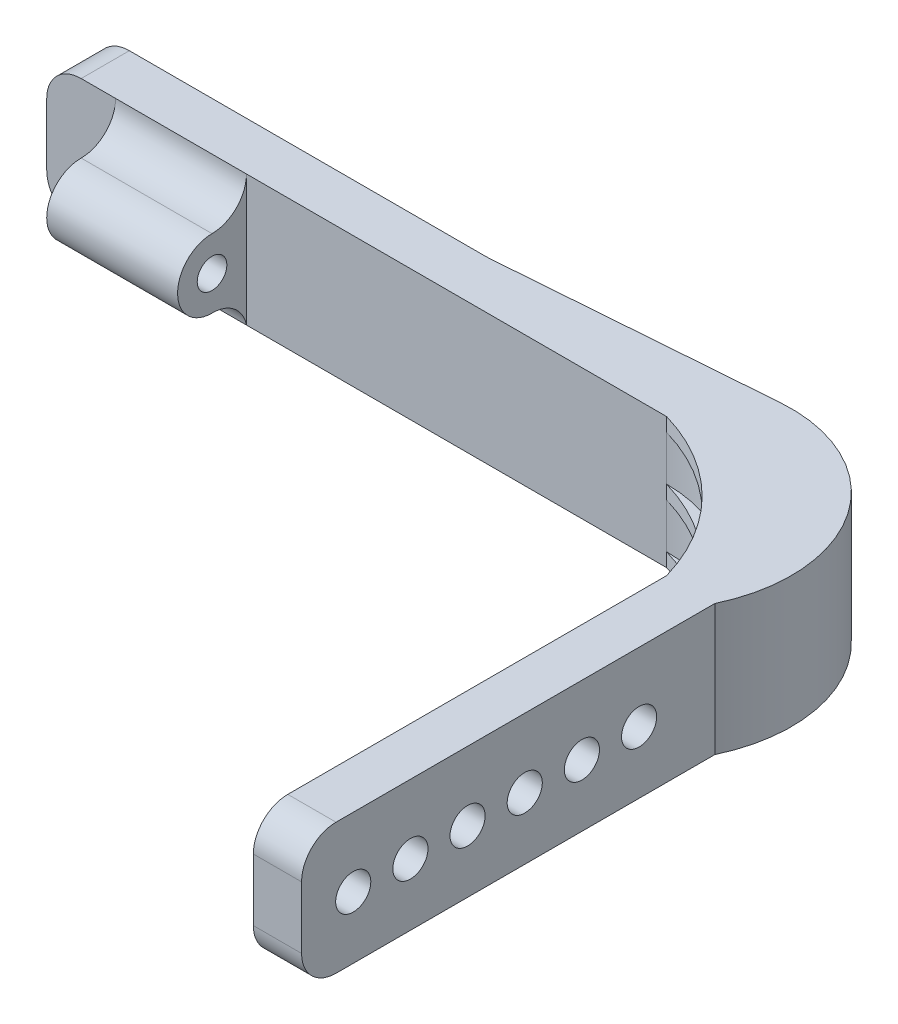
ISO-10303-21;
HEADER;
FILE_DESCRIPTION(('STEP AP214'),'2;1');
FILE_NAME('part.step','',(''),(''),'','','');
FILE_SCHEMA(('AUTOMOTIVE_DESIGN { 1 0 10303 214 1 1 1 1 }'));
ENDSEC;
DATA;
#1=APPLICATION_CONTEXT('core data for automotive mechanical design processes');
#2=APPLICATION_PROTOCOL_DEFINITION('international standard','automotive_design',2000,#1);
#3=PRODUCT_CONTEXT('',#1,'mechanical');
#4=PRODUCT('Part','Part','',(#3));
#5=PRODUCT_RELATED_PRODUCT_CATEGORY('part','',(#4));
#6=PRODUCT_DEFINITION_FORMATION('','',#4);
#7=PRODUCT_DEFINITION_CONTEXT('part definition',#1,'design');
#8=PRODUCT_DEFINITION('design','',#6,#7);
#9=PRODUCT_DEFINITION_SHAPE('','',#8);
#10=(LENGTH_UNIT() NAMED_UNIT(*) SI_UNIT(.MILLI.,.METRE.));
#11=(NAMED_UNIT(*) PLANE_ANGLE_UNIT() SI_UNIT($,.RADIAN.));
#12=(NAMED_UNIT(*) SI_UNIT($,.STERADIAN.) SOLID_ANGLE_UNIT());
#13=UNCERTAINTY_MEASURE_WITH_UNIT(LENGTH_MEASURE(1.E-05),#10,'distance_accuracy_value','');
#14=(GEOMETRIC_REPRESENTATION_CONTEXT(3) GLOBAL_UNCERTAINTY_ASSIGNED_CONTEXT((#13)) GLOBAL_UNIT_ASSIGNED_CONTEXT((#10,
#11,#12)) REPRESENTATION_CONTEXT('',''));
#15=CARTESIAN_POINT('',(0.,0.,0.));
#16=DIRECTION('',(0.,0.,1.));
#17=DIRECTION('',(1.,0.,0.));
#18=AXIS2_PLACEMENT_3D('',#15,#16,#17);
#19=CARTESIAN_POINT('',(0.,19.,7.));
#20=DIRECTION('',(0.,0.,-1.));
#21=DIRECTION('',(-1.,0.,0.));
#22=AXIS2_PLACEMENT_3D('',#19,#20,#21);
#23=PLANE('',#22);
#24=DIRECTION('',(1.,0.,0.));
#25=VECTOR('',#24,1.);
#26=CARTESIAN_POINT('',(0.,0.,7.));
#27=LINE('',#26,#25);
#28=CARTESIAN_POINT('',(5.,0.,7.));
#29=VERTEX_POINT('',#28);
#30=CARTESIAN_POINT('',(10.,0.,7.));
#31=VERTEX_POINT('',#30);
#32=EDGE_CURVE('E343',#29,#31,#27,.T.);
#33=ORIENTED_EDGE('',*,*,#32,.T.);
#34=DIRECTION('',(0.,-1.,0.));
#35=VECTOR('',#34,1.);
#36=CARTESIAN_POINT('',(10.,14.,7.));
#37=LINE('',#36,#35);
#38=CARTESIAN_POINT('',(10.,19.,7.));
#39=VERTEX_POINT('',#38);
#40=EDGE_CURVE('E225',#39,#31,#37,.T.);
#41=ORIENTED_EDGE('',*,*,#40,.F.);
#42=DIRECTION('',(1.,0.,0.));
#43=VECTOR('',#42,1.);
#44=CARTESIAN_POINT('',(0.,19.,7.));
#45=LINE('',#44,#43);
#46=CARTESIAN_POINT('',(5.,19.,7.));
#47=VERTEX_POINT('',#46);
#48=EDGE_CURVE('E326',#47,#39,#45,.T.);
#49=ORIENTED_EDGE('',*,*,#48,.F.);
#50=CARTESIAN_POINT('',(5.,14.,7.));
#51=DIRECTION('',(0.,0.,-1.));
#52=DIRECTION('',(-1.,0.,0.));
#53=AXIS2_PLACEMENT_3D('',#50,#51,#52);
#54=CIRCLE('',#53,5.);
#55=CARTESIAN_POINT('',(0.,14.,7.));
#56=VERTEX_POINT('',#55);
#57=EDGE_CURVE('E462',#47,#56,#54,.F.);
#58=ORIENTED_EDGE('',*,*,#57,.T.);
#59=DIRECTION('',(0.,-1.,0.));
#60=VECTOR('',#59,1.);
#61=CARTESIAN_POINT('',(0.,19.,7.));
#62=LINE('',#61,#60);
#63=CARTESIAN_POINT('',(0.,5.,7.));
#64=VERTEX_POINT('',#63);
#65=EDGE_CURVE('E384',#56,#64,#62,.T.);
#66=ORIENTED_EDGE('',*,*,#65,.T.);
#67=CARTESIAN_POINT('',(5.,5.,7.));
#68=DIRECTION('',(0.,0.,-1.));
#69=DIRECTION('',(-1.,0.,0.));
#70=AXIS2_PLACEMENT_3D('',#67,#68,#69);
#71=CIRCLE('',#70,5.);
#72=EDGE_CURVE('E465',#64,#29,#71,.F.);
#73=ORIENTED_EDGE('',*,*,#72,.T.);
#74=EDGE_LOOP('',(#33,#41,#49,#58,#66,#73));
#75=FACE_BOUND('',#74,.T.);
#76=ADVANCED_FACE('F43',(#75),#23,.F.);
#77=CARTESIAN_POINT('',(90.,19.,27.));
#78=DIRECTION('',(0.,-1.,0.));
#79=DIRECTION('',(0.,0.,-1.));
#80=AXIS2_PLACEMENT_3D('',#77,#78,#79);
#81=CYLINDRICAL_SURFACE('',#80,20.);
#82=DIRECTION('',(0.,-1.,0.));
#83=VECTOR('',#82,1.);
#84=CARTESIAN_POINT('',(110.,19.,27.));
#85=LINE('',#84,#83);
#86=CARTESIAN_POINT('',(110.,17.,27.));
#87=VERTEX_POINT('',#86);
#88=CARTESIAN_POINT('',(110.,10.5,27.));
#89=VERTEX_POINT('',#88);
#90=EDGE_CURVE('E379',#87,#89,#85,.T.);
#91=ORIENTED_EDGE('',*,*,#90,.F.);
#92=CARTESIAN_POINT('',(90.,17.,27.));
#93=DIRECTION('',(0.,1.,0.));
#94=DIRECTION('',(0.,0.,-1.));
#95=AXIS2_PLACEMENT_3D('',#92,#93,#94);
#96=CIRCLE('',#95,20.);
#97=CARTESIAN_POINT('',(90.,17.,7.));
#98=VERTEX_POINT('',#97);
#99=EDGE_CURVE('E235',#87,#98,#96,.T.);
#100=ORIENTED_EDGE('',*,*,#99,.T.);
#101=DIRECTION('',(0.,-1.,0.));
#102=VECTOR('',#101,1.);
#103=CARTESIAN_POINT('',(90.,19.,7.));
#104=LINE('',#103,#102);
#105=CARTESIAN_POINT('',(90.,10.5,7.));
#106=VERTEX_POINT('',#105);
#107=EDGE_CURVE('E385',#98,#106,#104,.T.);
#108=ORIENTED_EDGE('',*,*,#107,.T.);
#109=CARTESIAN_POINT('',(90.,10.5,27.));
#110=DIRECTION('',(0.,1.,0.));
#111=DIRECTION('',(0.,0.,-1.));
#112=AXIS2_PLACEMENT_3D('',#109,#110,#111);
#113=CIRCLE('',#112,20.);
#114=EDGE_CURVE('E248',#89,#106,#113,.T.);
#115=ORIENTED_EDGE('',*,*,#114,.F.);
#116=EDGE_LOOP('',(#91,#100,#108,#115));
#117=FACE_BOUND('',#116,.T.);
#118=ADVANCED_FACE('F550',(#117),#81,.F.);
#119=CARTESIAN_POINT('',(110.,8.5,27.));
#120=VERTEX_POINT('',#119);
#121=CARTESIAN_POINT('',(110.,2.,27.));
#122=VERTEX_POINT('',#121);
#123=EDGE_CURVE('E373',#120,#122,#85,.T.);
#124=ORIENTED_EDGE('',*,*,#123,.F.);
#125=CARTESIAN_POINT('',(90.,8.5,27.));
#126=DIRECTION('',(0.,1.,0.));
#127=DIRECTION('',(0.,0.,-1.));
#128=AXIS2_PLACEMENT_3D('',#125,#126,#127);
#129=CIRCLE('',#128,20.);
#130=CARTESIAN_POINT('',(90.,8.5,7.));
#131=VERTEX_POINT('',#130);
#132=EDGE_CURVE('E241',#120,#131,#129,.T.);
#133=ORIENTED_EDGE('',*,*,#132,.T.);
#134=CARTESIAN_POINT('',(90.,2.,7.));
#135=VERTEX_POINT('',#134);
#136=EDGE_CURVE('E378',#131,#135,#104,.T.);
#137=ORIENTED_EDGE('',*,*,#136,.T.);
#138=CARTESIAN_POINT('',(90.,2.,27.));
#139=DIRECTION('',(0.,1.,0.));
#140=DIRECTION('',(0.,0.,-1.));
#141=AXIS2_PLACEMENT_3D('',#138,#139,#140);
#142=CIRCLE('',#141,20.);
#143=EDGE_CURVE('E272',#122,#135,#142,.T.);
#144=ORIENTED_EDGE('',*,*,#143,.F.);
#145=EDGE_LOOP('',(#124,#133,#137,#144));
#146=FACE_BOUND('',#145,.T.);
#147=ADVANCED_FACE('F528',(#146),#81,.F.);
#148=CARTESIAN_POINT('',(0.,19.,0.));
#149=DIRECTION('',(0.,0.,1.));
#150=DIRECTION('',(1.,0.,0.));
#151=AXIS2_PLACEMENT_3D('',#148,#149,#150);
#152=PLANE('',#151);
#153=DIRECTION('',(-1.,0.,0.));
#154=VECTOR('',#153,1.);
#155=CARTESIAN_POINT('',(0.,19.,0.));
#156=LINE('',#155,#154);
#157=CARTESIAN_POINT('',(56.3075252884527,19.,0.));
#158=VERTEX_POINT('',#157);
#159=CARTESIAN_POINT('',(5.,19.,0.));
#160=VERTEX_POINT('',#159);
#161=EDGE_CURVE('E339',#158,#160,#156,.T.);
#162=ORIENTED_EDGE('',*,*,#161,.F.);
#163=DIRECTION('',(0.,-1.,0.));
#164=VECTOR('',#163,1.);
#165=CARTESIAN_POINT('',(56.3075252884527,0.,0.));
#166=LINE('',#165,#164);
#167=CARTESIAN_POINT('',(56.3075252884527,0.,0.));
#168=VERTEX_POINT('',#167);
#169=EDGE_CURVE('E475',#158,#168,#166,.T.);
#170=ORIENTED_EDGE('',*,*,#169,.T.);
#171=DIRECTION('',(-1.,0.,0.));
#172=VECTOR('',#171,1.);
#173=CARTESIAN_POINT('',(0.,0.,0.));
#174=LINE('',#173,#172);
#175=CARTESIAN_POINT('',(5.,0.,0.));
#176=VERTEX_POINT('',#175);
#177=EDGE_CURVE('E355',#168,#176,#174,.T.);
#178=ORIENTED_EDGE('',*,*,#177,.T.);
#179=CARTESIAN_POINT('',(5.,5.,0.));
#180=DIRECTION('',(0.,0.,1.));
#181=DIRECTION('',(1.,0.,0.));
#182=AXIS2_PLACEMENT_3D('',#179,#180,#181);
#183=CIRCLE('',#182,5.);
#184=CARTESIAN_POINT('',(0.,5.,0.));
#185=VERTEX_POINT('',#184);
#186=EDGE_CURVE('E472',#176,#185,#183,.F.);
#187=ORIENTED_EDGE('',*,*,#186,.T.);
#188=DIRECTION('',(0.,-1.,0.));
#189=VECTOR('',#188,1.);
#190=CARTESIAN_POINT('',(0.,19.,0.));
#191=LINE('',#190,#189);
#192=CARTESIAN_POINT('',(0.,14.,0.));
#193=VERTEX_POINT('',#192);
#194=EDGE_CURVE('E342',#193,#185,#191,.T.);
#195=ORIENTED_EDGE('',*,*,#194,.F.);
#196=CARTESIAN_POINT('',(5.,14.,0.));
#197=DIRECTION('',(0.,0.,1.));
#198=DIRECTION('',(1.,0.,0.));
#199=AXIS2_PLACEMENT_3D('',#196,#197,#198);
#200=CIRCLE('',#199,5.);
#201=EDGE_CURVE('E468',#193,#160,#200,.F.);
#202=ORIENTED_EDGE('',*,*,#201,.T.);
#203=EDGE_LOOP('',(#162,#170,#178,#187,#195,#202));
#204=FACE_BOUND('',#203,.T.);
#205=ADVANCED_FACE('F586',(#204),#152,.F.);
#206=CARTESIAN_POINT('',(117.,9.,38.));
#207=DIRECTION('',(-1.,0.,0.));
#208=DIRECTION('',(0.,0.,1.));
#209=AXIS2_PLACEMENT_3D('',#206,#207,#208);
#210=CYLINDRICAL_SURFACE('',#209,2.54999999999999);
#211=CARTESIAN_POINT('',(117.,9.,38.));
#212=DIRECTION('',(1.,0.,0.));
#213=DIRECTION('',(0.,0.,-1.));
#214=AXIS2_PLACEMENT_3D('',#211,#212,#213);
#215=CIRCLE('',#214,2.54999999999999);
#216=CARTESIAN_POINT('',(117.,9.,35.45));
#217=VERTEX_POINT('',#216);
#218=EDGE_CURVE('E413',#217,#217,#215,.T.);
#219=ORIENTED_EDGE('',*,*,#218,.T.);
#220=EDGE_LOOP('',(#219));
#221=FACE_BOUND('',#220,.T.);
#222=CARTESIAN_POINT('',(110.,9.,38.));
#223=DIRECTION('',(1.,0.,0.));
#224=DIRECTION('',(0.,0.,-1.));
#225=AXIS2_PLACEMENT_3D('',#222,#223,#224);
#226=CIRCLE('',#225,2.54999999999999);
#227=CARTESIAN_POINT('',(110.,9.,35.45));
#228=VERTEX_POINT('',#227);
#229=EDGE_CURVE('E417',#228,#228,#226,.F.);
#230=ORIENTED_EDGE('',*,*,#229,.T.);
#231=EDGE_LOOP('',(#230));
#232=FACE_BOUND('',#231,.T.);
#233=ADVANCED_FACE('F582',(#221,#232),#210,.F.);
#234=CARTESIAN_POINT('',(117.,9.,46.3));
#235=DIRECTION('',(-1.,0.,0.));
#236=DIRECTION('',(0.,0.,1.));
#237=AXIS2_PLACEMENT_3D('',#234,#235,#236);
#238=CYLINDRICAL_SURFACE('',#237,2.54999999999999);
#239=CARTESIAN_POINT('',(117.,9.,46.3));
#240=DIRECTION('',(1.,0.,0.));
#241=DIRECTION('',(0.,0.,-1.));
#242=AXIS2_PLACEMENT_3D('',#239,#240,#241);
#243=CIRCLE('',#242,2.54999999999999);
#244=CARTESIAN_POINT('',(117.,9.,43.75));
#245=VERTEX_POINT('',#244);
#246=EDGE_CURVE('E405',#245,#245,#243,.T.);
#247=ORIENTED_EDGE('',*,*,#246,.T.);
#248=EDGE_LOOP('',(#247));
#249=FACE_BOUND('',#248,.T.);
#250=CARTESIAN_POINT('',(110.,9.,46.3));
#251=DIRECTION('',(1.,0.,0.));
#252=DIRECTION('',(0.,0.,-1.));
#253=AXIS2_PLACEMENT_3D('',#250,#251,#252);
#254=CIRCLE('',#253,2.54999999999999);
#255=CARTESIAN_POINT('',(110.,9.,43.75));
#256=VERTEX_POINT('',#255);
#257=EDGE_CURVE('E409',#256,#256,#254,.F.);
#258=ORIENTED_EDGE('',*,*,#257,.T.);
#259=EDGE_LOOP('',(#258));
#260=FACE_BOUND('',#259,.T.);
#261=ADVANCED_FACE('F578',(#249,#260),#238,.F.);
#262=CARTESIAN_POINT('',(117.,9.,54.6));
#263=DIRECTION('',(-1.,0.,0.));
#264=DIRECTION('',(0.,0.,1.));
#265=AXIS2_PLACEMENT_3D('',#262,#263,#264);
#266=CYLINDRICAL_SURFACE('',#265,2.54999999999999);
#267=CARTESIAN_POINT('',(117.,9.,54.6));
#268=DIRECTION('',(1.,0.,0.));
#269=DIRECTION('',(0.,0.,-1.));
#270=AXIS2_PLACEMENT_3D('',#267,#268,#269);
#271=CIRCLE('',#270,2.54999999999999);
#272=CARTESIAN_POINT('',(117.,9.,52.05));
#273=VERTEX_POINT('',#272);
#274=EDGE_CURVE('E397',#273,#273,#271,.T.);
#275=ORIENTED_EDGE('',*,*,#274,.T.);
#276=EDGE_LOOP('',(#275));
#277=FACE_BOUND('',#276,.T.);
#278=CARTESIAN_POINT('',(110.,9.,54.6));
#279=DIRECTION('',(1.,0.,0.));
#280=DIRECTION('',(0.,0.,-1.));
#281=AXIS2_PLACEMENT_3D('',#278,#279,#280);
#282=CIRCLE('',#281,2.54999999999999);
#283=CARTESIAN_POINT('',(110.,9.,52.05));
#284=VERTEX_POINT('',#283);
#285=EDGE_CURVE('E401',#284,#284,#282,.F.);
#286=ORIENTED_EDGE('',*,*,#285,.T.);
#287=EDGE_LOOP('',(#286));
#288=FACE_BOUND('',#287,.T.);
#289=ADVANCED_FACE('F572',(#277,#288),#266,.F.);
#290=CARTESIAN_POINT('',(117.,9.,62.9));
#291=DIRECTION('',(-1.,0.,0.));
#292=DIRECTION('',(0.,0.,1.));
#293=AXIS2_PLACEMENT_3D('',#290,#291,#292);
#294=CYLINDRICAL_SURFACE('',#293,2.54999999999999);
#295=CARTESIAN_POINT('',(117.,9.,62.9));
#296=DIRECTION('',(1.,0.,0.));
#297=DIRECTION('',(0.,0.,-1.));
#298=AXIS2_PLACEMENT_3D('',#295,#296,#297);
#299=CIRCLE('',#298,2.54999999999999);
#300=CARTESIAN_POINT('',(117.,9.,60.35));
#301=VERTEX_POINT('',#300);
#302=EDGE_CURVE('E389',#301,#301,#299,.T.);
#303=ORIENTED_EDGE('',*,*,#302,.T.);
#304=EDGE_LOOP('',(#303));
#305=FACE_BOUND('',#304,.T.);
#306=CARTESIAN_POINT('',(110.,9.,62.9));
#307=DIRECTION('',(1.,0.,0.));
#308=DIRECTION('',(0.,0.,-1.));
#309=AXIS2_PLACEMENT_3D('',#306,#307,#308);
#310=CIRCLE('',#309,2.54999999999999);
#311=CARTESIAN_POINT('',(110.,9.,60.35));
#312=VERTEX_POINT('',#311);
#313=EDGE_CURVE('E393',#312,#312,#310,.F.);
#314=ORIENTED_EDGE('',*,*,#313,.T.);
#315=EDGE_LOOP('',(#314));
#316=FACE_BOUND('',#315,.T.);
#317=ADVANCED_FACE('F567',(#305,#316),#294,.F.);
#318=CARTESIAN_POINT('',(0.,19.,7.));
#319=DIRECTION('',(1.,0.,0.));
#320=DIRECTION('',(0.,0.,-1.));
#321=AXIS2_PLACEMENT_3D('',#318,#319,#320);
#322=PLANE('',#321);
#323=ORIENTED_EDGE('',*,*,#194,.T.);
#324=DIRECTION('',(0.,0.,1.));
#325=VECTOR('',#324,1.);
#326=CARTESIAN_POINT('',(0.,5.,7.));
#327=LINE('',#326,#325);
#328=EDGE_CURVE('E458',#185,#64,#327,.T.);
#329=ORIENTED_EDGE('',*,*,#328,.T.);
#330=ORIENTED_EDGE('',*,*,#65,.F.);
#331=DIRECTION('',(0.,0.,1.));
#332=VECTOR('',#331,1.);
#333=CARTESIAN_POINT('',(0.,14.,7.));
#334=LINE('',#333,#332);
#335=EDGE_CURVE('E455',#56,#193,#334,.F.);
#336=ORIENTED_EDGE('',*,*,#335,.T.);
#337=EDGE_LOOP('',(#323,#329,#330,#336));
#338=FACE_BOUND('',#337,.T.);
#339=ADVANCED_FACE('F559',(#338),#322,.F.);
#340=DIRECTION('',(0.,-1.,0.));
#341=VECTOR('',#340,1.);
#342=CARTESIAN_POINT('',(29.,14.,7.));
#343=LINE('',#342,#341);
#344=CARTESIAN_POINT('',(29.,19.,7.));
#345=VERTEX_POINT('',#344);
#346=CARTESIAN_POINT('',(29.,0.,7.));
#347=VERTEX_POINT('',#346);
#348=EDGE_CURVE('E207',#345,#347,#343,.T.);
#349=ORIENTED_EDGE('',*,*,#348,.T.);
#350=CARTESIAN_POINT('',(90.,0.,7.));
#351=VERTEX_POINT('',#350);
#352=EDGE_CURVE('E325',#347,#351,#27,.T.);
#353=ORIENTED_EDGE('',*,*,#352,.T.);
#354=DIRECTION('',(0.,-1.,0.));
#355=VECTOR('',#354,1.);
#356=CARTESIAN_POINT('',(90.,2.,7.));
#357=LINE('',#356,#355);
#358=EDGE_CURVE('E287',#135,#351,#357,.T.);
#359=ORIENTED_EDGE('',*,*,#358,.F.);
#360=ORIENTED_EDGE('',*,*,#136,.F.);
#361=DIRECTION('',(0.,-1.,0.));
#362=VECTOR('',#361,1.);
#363=CARTESIAN_POINT('',(90.,10.5,7.));
#364=LINE('',#363,#362);
#365=EDGE_CURVE('E267',#106,#131,#364,.T.);
#366=ORIENTED_EDGE('',*,*,#365,.F.);
#367=ORIENTED_EDGE('',*,*,#107,.F.);
#368=CARTESIAN_POINT('',(90.,19.,7.));
#369=VERTEX_POINT('',#368);
#370=EDGE_CURVE('E380',#369,#98,#104,.T.);
#371=ORIENTED_EDGE('',*,*,#370,.F.);
#372=EDGE_CURVE('E332',#345,#369,#45,.T.);
#373=ORIENTED_EDGE('',*,*,#372,.F.);
#374=EDGE_LOOP('',(#349,#353,#359,#360,#366,#367,#371,#373));
#375=FACE_BOUND('',#374,.T.);
#376=ADVANCED_FACE('F516',(#375),#23,.F.);
#377=CARTESIAN_POINT('',(110.,19.,27.));
#378=DIRECTION('',(1.,0.,0.));
#379=DIRECTION('',(0.,0.,-1.));
#380=AXIS2_PLACEMENT_3D('',#377,#378,#379);
#381=PLANE('',#380);
#382=CARTESIAN_POINT('',(110.,9.,71.2));
#383=DIRECTION('',(1.,0.,0.));
#384=DIRECTION('',(0.,0.,-1.));
#385=AXIS2_PLACEMENT_3D('',#382,#383,#384);
#386=CIRCLE('',#385,2.54999999999999);
#387=CARTESIAN_POINT('',(110.,9.,68.65));
#388=VERTEX_POINT('',#387);
#389=EDGE_CURVE('E313',#388,#388,#386,.F.);
#390=ORIENTED_EDGE('',*,*,#389,.F.);
#391=EDGE_LOOP('',(#390));
#392=FACE_BOUND('',#391,.T.);
#393=CARTESIAN_POINT('',(110.,9.,79.5));
#394=DIRECTION('',(1.,0.,0.));
#395=DIRECTION('',(0.,0.,-1.));
#396=AXIS2_PLACEMENT_3D('',#393,#394,#395);
#397=CIRCLE('',#396,2.54999999999999);
#398=CARTESIAN_POINT('',(110.,9.,76.95));
#399=VERTEX_POINT('',#398);
#400=EDGE_CURVE('E321',#399,#399,#397,.F.);
#401=ORIENTED_EDGE('',*,*,#400,.F.);
#402=EDGE_LOOP('',(#401));
#403=FACE_BOUND('',#402,.T.);
#404=DIRECTION('',(0.,0.,1.));
#405=VECTOR('',#404,1.);
#406=CARTESIAN_POINT('',(110.,0.,27.));
#407=LINE('',#406,#405);
#408=CARTESIAN_POINT('',(110.,0.,27.));
#409=VERTEX_POINT('',#408);
#410=CARTESIAN_POINT('',(110.,0.,82.));
#411=VERTEX_POINT('',#410);
#412=EDGE_CURVE('E347',#409,#411,#407,.T.);
#413=ORIENTED_EDGE('',*,*,#412,.T.);
#414=CARTESIAN_POINT('',(110.,5.,82.));
#415=DIRECTION('',(1.,0.,0.));
#416=DIRECTION('',(0.,0.,-1.));
#417=AXIS2_PLACEMENT_3D('',#414,#415,#416);
#418=CIRCLE('',#417,5.);
#419=CARTESIAN_POINT('',(110.,5.,87.));
#420=VERTEX_POINT('',#419);
#421=EDGE_CURVE('E444',#411,#420,#418,.F.);
#422=ORIENTED_EDGE('',*,*,#421,.T.);
#423=DIRECTION('',(0.,-1.,0.));
#424=VECTOR('',#423,1.);
#425=CARTESIAN_POINT('',(110.,19.,87.));
#426=LINE('',#425,#424);
#427=CARTESIAN_POINT('',(110.,14.,87.));
#428=VERTEX_POINT('',#427);
#429=EDGE_CURVE('E369',#428,#420,#426,.T.);
#430=ORIENTED_EDGE('',*,*,#429,.F.);
#431=CARTESIAN_POINT('',(110.,14.,82.));
#432=DIRECTION('',(1.,0.,0.));
#433=DIRECTION('',(0.,0.,-1.));
#434=AXIS2_PLACEMENT_3D('',#431,#432,#433);
#435=CIRCLE('',#434,5.);
#436=CARTESIAN_POINT('',(110.,19.,82.));
#437=VERTEX_POINT('',#436);
#438=EDGE_CURVE('E441',#428,#437,#435,.F.);
#439=ORIENTED_EDGE('',*,*,#438,.T.);
#440=DIRECTION('',(0.,0.,1.));
#441=VECTOR('',#440,1.);
#442=CARTESIAN_POINT('',(110.,19.,27.));
#443=LINE('',#442,#441);
#444=CARTESIAN_POINT('',(110.,19.,27.));
#445=VERTEX_POINT('',#444);
#446=EDGE_CURVE('E330',#445,#437,#443,.T.);
#447=ORIENTED_EDGE('',*,*,#446,.F.);
#448=EDGE_CURVE('E374',#445,#87,#85,.T.);
#449=ORIENTED_EDGE('',*,*,#448,.T.);
#450=ORIENTED_EDGE('',*,*,#90,.T.);
#451=DIRECTION('',(0.,-1.,0.));
#452=VECTOR('',#451,1.);
#453=CARTESIAN_POINT('',(110.,10.5,27.));
#454=LINE('',#453,#452);
#455=EDGE_CURVE('E257',#89,#120,#454,.T.);
#456=ORIENTED_EDGE('',*,*,#455,.T.);
#457=ORIENTED_EDGE('',*,*,#123,.T.);
#458=DIRECTION('',(0.,-1.,0.));
#459=VECTOR('',#458,1.);
#460=CARTESIAN_POINT('',(110.,2.,27.));
#461=LINE('',#460,#459);
#462=EDGE_CURVE('E280',#122,#409,#461,.T.);
#463=ORIENTED_EDGE('',*,*,#462,.T.);
#464=EDGE_LOOP('',(#413,#422,#430,#439,#447,#449,#450,#456,#457,#463));
#465=FACE_BOUND('',#464,.T.);
#466=ORIENTED_EDGE('',*,*,#313,.F.);
#467=EDGE_LOOP('',(#466));
#468=FACE_BOUND('',#467,.T.);
#469=ORIENTED_EDGE('',*,*,#285,.F.);
#470=EDGE_LOOP('',(#469));
#471=FACE_BOUND('',#470,.T.);
#472=ORIENTED_EDGE('',*,*,#257,.F.);
#473=EDGE_LOOP('',(#472));
#474=FACE_BOUND('',#473,.T.);
#475=ORIENTED_EDGE('',*,*,#229,.F.);
#476=EDGE_LOOP('',(#475));
#477=FACE_BOUND('',#476,.T.);
#478=ADVANCED_FACE('F558',(#392,#403,#465,#468,#471,#474,#477),#381,.F.);
#479=CARTESIAN_POINT('',(110.,19.,87.));
#480=DIRECTION('',(0.,0.,-1.));
#481=DIRECTION('',(-1.,0.,0.));
#482=AXIS2_PLACEMENT_3D('',#479,#480,#481);
#483=PLANE('',#482);
#484=ORIENTED_EDGE('',*,*,#429,.T.);
#485=DIRECTION('',(1.,0.,0.));
#486=VECTOR('',#485,1.);
#487=CARTESIAN_POINT('',(117.,5.,87.));
#488=LINE('',#487,#486);
#489=CARTESIAN_POINT('',(117.,5.,87.));
#490=VERTEX_POINT('',#489);
#491=EDGE_CURVE('E424',#420,#490,#488,.T.);
#492=ORIENTED_EDGE('',*,*,#491,.T.);
#493=DIRECTION('',(0.,-1.,0.));
#494=VECTOR('',#493,1.);
#495=CARTESIAN_POINT('',(117.,19.,87.));
#496=LINE('',#495,#494);
#497=CARTESIAN_POINT('',(117.,14.,87.));
#498=VERTEX_POINT('',#497);
#499=EDGE_CURVE('E365',#498,#490,#496,.T.);
#500=ORIENTED_EDGE('',*,*,#499,.F.);
#501=DIRECTION('',(1.,0.,0.));
#502=VECTOR('',#501,1.);
#503=CARTESIAN_POINT('',(110.,14.,87.));
#504=LINE('',#503,#502);
#505=EDGE_CURVE('E421',#498,#428,#504,.F.);
#506=ORIENTED_EDGE('',*,*,#505,.T.);
#507=EDGE_LOOP('',(#484,#492,#500,#506));
#508=FACE_BOUND('',#507,.T.);
#509=ADVANCED_FACE('F564',(#508),#483,.F.);
#510=CARTESIAN_POINT('',(117.,19.,27.));
#511=DIRECTION('',(-1.,0.,0.));
#512=DIRECTION('',(0.,0.,1.));
#513=AXIS2_PLACEMENT_3D('',#510,#511,#512);
#514=PLANE('',#513);
#515=CARTESIAN_POINT('',(117.,9.,71.2));
#516=DIRECTION('',(1.,0.,0.));
#517=DIRECTION('',(0.,0.,-1.));
#518=AXIS2_PLACEMENT_3D('',#515,#516,#517);
#519=CIRCLE('',#518,2.54999999999999);
#520=CARTESIAN_POINT('',(117.,9.,68.65));
#521=VERTEX_POINT('',#520);
#522=EDGE_CURVE('E300',#521,#521,#519,.T.);
#523=ORIENTED_EDGE('',*,*,#522,.F.);
#524=EDGE_LOOP('',(#523));
#525=FACE_BOUND('',#524,.T.);
#526=CARTESIAN_POINT('',(117.,9.,79.5));
#527=DIRECTION('',(1.,0.,0.));
#528=DIRECTION('',(0.,0.,-1.));
#529=AXIS2_PLACEMENT_3D('',#526,#527,#528);
#530=CIRCLE('',#529,2.54999999999999);
#531=CARTESIAN_POINT('',(117.,9.,76.95));
#532=VERTEX_POINT('',#531);
#533=EDGE_CURVE('E317',#532,#532,#530,.T.);
#534=ORIENTED_EDGE('',*,*,#533,.F.);
#535=EDGE_LOOP('',(#534));
#536=FACE_BOUND('',#535,.T.);
#537=ORIENTED_EDGE('',*,*,#499,.T.);
#538=CARTESIAN_POINT('',(117.,5.,82.));
#539=DIRECTION('',(-1.,0.,0.));
#540=DIRECTION('',(0.,0.,1.));
#541=AXIS2_PLACEMENT_3D('',#538,#539,#540);
#542=CIRCLE('',#541,5.);
#543=CARTESIAN_POINT('',(117.,0.,82.));
#544=VERTEX_POINT('',#543);
#545=EDGE_CURVE('E431',#490,#544,#542,.F.);
#546=ORIENTED_EDGE('',*,*,#545,.T.);
#547=DIRECTION('',(0.,0.,-1.));
#548=VECTOR('',#547,1.);
#549=CARTESIAN_POINT('',(117.,0.,27.));
#550=LINE('',#549,#548);
#551=CARTESIAN_POINT('',(117.,0.,27.));
#552=VERTEX_POINT('',#551);
#553=EDGE_CURVE('E352',#544,#552,#550,.T.);
#554=ORIENTED_EDGE('',*,*,#553,.T.);
#555=DIRECTION('',(0.,-1.,0.));
#556=VECTOR('',#555,1.);
#557=CARTESIAN_POINT('',(117.,19.,27.));
#558=LINE('',#557,#556);
#559=CARTESIAN_POINT('',(117.,19.,27.));
#560=VERTEX_POINT('',#559);
#561=EDGE_CURVE('E361',#560,#552,#558,.T.);
#562=ORIENTED_EDGE('',*,*,#561,.F.);
#563=DIRECTION('',(0.,0.,-1.));
#564=VECTOR('',#563,1.);
#565=CARTESIAN_POINT('',(117.,19.,27.));
#566=LINE('',#565,#564);
#567=CARTESIAN_POINT('',(117.,19.,82.));
#568=VERTEX_POINT('',#567);
#569=EDGE_CURVE('E336',#568,#560,#566,.T.);
#570=ORIENTED_EDGE('',*,*,#569,.F.);
#571=CARTESIAN_POINT('',(117.,14.,82.));
#572=DIRECTION('',(-1.,0.,0.));
#573=DIRECTION('',(0.,0.,1.));
#574=AXIS2_PLACEMENT_3D('',#571,#572,#573);
#575=CIRCLE('',#574,5.);
#576=EDGE_CURVE('E428',#568,#498,#575,.F.);
#577=ORIENTED_EDGE('',*,*,#576,.T.);
#578=EDGE_LOOP('',(#537,#546,#554,#562,#570,#577));
#579=FACE_BOUND('',#578,.T.);
#580=ORIENTED_EDGE('',*,*,#302,.F.);
#581=EDGE_LOOP('',(#580));
#582=FACE_BOUND('',#581,.T.);
#583=ORIENTED_EDGE('',*,*,#274,.F.);
#584=EDGE_LOOP('',(#583));
#585=FACE_BOUND('',#584,.T.);
#586=ORIENTED_EDGE('',*,*,#246,.F.);
#587=EDGE_LOOP('',(#586));
#588=FACE_BOUND('',#587,.T.);
#589=ORIENTED_EDGE('',*,*,#218,.F.);
#590=EDGE_LOOP('',(#589));
#591=FACE_BOUND('',#590,.T.);
#592=ADVANCED_FACE('F708',(#525,#536,#579,#582,#585,#588,#591),#514,.F.);
#593=CARTESIAN_POINT('',(90.,19.,27.));
#594=DIRECTION('',(0.,-1.,0.));
#595=DIRECTION('',(0.,0.,-1.));
#596=AXIS2_PLACEMENT_3D('',#593,#594,#595);
#597=PLANE('',#596);
#598=DIRECTION('',(0.99711264567793,0.,-0.0759366303516227));
#599=VECTOR('',#598,1.);
#600=CARTESIAN_POINT('',(57.0679894567205,19.,0.));
#601=LINE('',#600,#599);
#602=CARTESIAN_POINT('',(57.8262578954852,19.,-0.0577470864414026));
#603=VERTEX_POINT('',#602);
#604=CARTESIAN_POINT('',(96.4605451071684,19.,-3.));
#605=VERTEX_POINT('',#604);
#606=EDGE_CURVE('E292',#603,#605,#601,.T.);
#607=ORIENTED_EDGE('',*,*,#606,.F.);
#608=CARTESIAN_POINT('',(56.3075252884527,19.,-20.));
#609=DIRECTION('',(0.,-1.,0.));
#610=DIRECTION('',(0.,0.,-1.));
#611=AXIS2_PLACEMENT_3D('',#608,#609,#610);
#612=CIRCLE('',#611,20.);
#613=EDGE_CURVE('E485',#603,#158,#612,.T.);
#614=ORIENTED_EDGE('',*,*,#613,.T.);
#615=ORIENTED_EDGE('',*,*,#161,.T.);
#616=DIRECTION('',(0.,0.,1.));
#617=VECTOR('',#616,1.);
#618=CARTESIAN_POINT('',(5.,19.,27.));
#619=LINE('',#618,#617);
#620=EDGE_CURVE('E447',#160,#47,#619,.T.);
#621=ORIENTED_EDGE('',*,*,#620,.T.);
#622=ORIENTED_EDGE('',*,*,#48,.T.);
#623=EDGE_CURVE('E331',#39,#345,#45,.T.);
#624=ORIENTED_EDGE('',*,*,#623,.T.);
#625=ORIENTED_EDGE('',*,*,#372,.T.);
#626=CARTESIAN_POINT('',(81.8988053183641,19.,35.1011946816359));
#627=DIRECTION('',(0.,-1.,0.));
#628=DIRECTION('',(0.,0.,-1.));
#629=AXIS2_PLACEMENT_3D('',#626,#627,#628);
#630=CIRCLE('',#629,29.2456235666974);
#631=EDGE_CURVE('E237',#369,#445,#630,.T.);
#632=ORIENTED_EDGE('',*,*,#631,.T.);
#633=ORIENTED_EDGE('',*,*,#446,.T.);
#634=DIRECTION('',(1.,0.,0.));
#635=VECTOR('',#634,1.);
#636=CARTESIAN_POINT('',(90.,19.,82.));
#637=LINE('',#636,#635);
#638=EDGE_CURVE('E451',#437,#568,#637,.T.);
#639=ORIENTED_EDGE('',*,*,#638,.T.);
#640=ORIENTED_EDGE('',*,*,#569,.T.);
#641=CARTESIAN_POINT('',(98.0552143445524,19.,17.9393655592365));
#642=DIRECTION('',(0.,-1.,0.));
#643=DIRECTION('',(0.,0.,-1.));
#644=AXIS2_PLACEMENT_3D('',#641,#642,#643);
#645=CIRCLE('',#644,21.);
#646=EDGE_CURVE('E295',#605,#560,#645,.T.);
#647=ORIENTED_EDGE('',*,*,#646,.F.);
#648=EDGE_LOOP('',(#607,#614,#615,#621,#622,#624,#625,#632,#633,#639,#640,#647));
#649=FACE_BOUND('',#648,.T.);
#650=ADVANCED_FACE('F503',(#649),#597,.F.);
#651=CARTESIAN_POINT('',(90.,0.,27.));
#652=DIRECTION('',(0.,-1.,0.));
#653=DIRECTION('',(0.,0.,-1.));
#654=AXIS2_PLACEMENT_3D('',#651,#652,#653);
#655=PLANE('',#654);
#656=ORIENTED_EDGE('',*,*,#177,.F.);
#657=CARTESIAN_POINT('',(56.3075252884527,0.,-20.));
#658=DIRECTION('',(0.,-1.,0.));
#659=DIRECTION('',(0.,0.,-1.));
#660=AXIS2_PLACEMENT_3D('',#657,#658,#659);
#661=CIRCLE('',#660,20.);
#662=CARTESIAN_POINT('',(57.8262578954852,0.,-0.0577470864414026));
#663=VERTEX_POINT('',#662);
#664=EDGE_CURVE('E482',#168,#663,#661,.F.);
#665=ORIENTED_EDGE('',*,*,#664,.T.);
#666=DIRECTION('',(-0.99711264567793,0.,0.0759366303516227));
#667=VECTOR('',#666,1.);
#668=CARTESIAN_POINT('',(57.0679894567205,0.,0.));
#669=LINE('',#668,#667);
#670=CARTESIAN_POINT('',(96.4605451071684,0.,-3.));
#671=VERTEX_POINT('',#670);
#672=EDGE_CURVE('E304',#671,#663,#669,.T.);
#673=ORIENTED_EDGE('',*,*,#672,.F.);
#674=CARTESIAN_POINT('',(98.0552143445524,0.,17.9393655592365));
#675=DIRECTION('',(0.,1.,0.));
#676=DIRECTION('',(0.,0.,1.));
#677=AXIS2_PLACEMENT_3D('',#674,#675,#676);
#678=CIRCLE('',#677,21.);
#679=EDGE_CURVE('E291',#552,#671,#678,.T.);
#680=ORIENTED_EDGE('',*,*,#679,.F.);
#681=ORIENTED_EDGE('',*,*,#553,.F.);
#682=DIRECTION('',(1.,0.,0.));
#683=VECTOR('',#682,1.);
#684=CARTESIAN_POINT('',(110.,0.,82.));
#685=LINE('',#684,#683);
#686=EDGE_CURVE('E438',#544,#411,#685,.F.);
#687=ORIENTED_EDGE('',*,*,#686,.T.);
#688=ORIENTED_EDGE('',*,*,#412,.F.);
#689=CARTESIAN_POINT('',(81.8988053183641,0.,35.1011946816359));
#690=DIRECTION('',(0.,-1.,0.));
#691=DIRECTION('',(0.,0.,-1.));
#692=AXIS2_PLACEMENT_3D('',#689,#690,#691);
#693=CIRCLE('',#692,29.2456235666974);
#694=EDGE_CURVE('E271',#351,#409,#693,.T.);
#695=ORIENTED_EDGE('',*,*,#694,.F.);
#696=ORIENTED_EDGE('',*,*,#352,.F.);
#697=EDGE_CURVE('E348',#31,#347,#27,.T.);
#698=ORIENTED_EDGE('',*,*,#697,.F.);
#699=ORIENTED_EDGE('',*,*,#32,.F.);
#700=DIRECTION('',(0.,0.,1.));
#701=VECTOR('',#700,1.);
#702=CARTESIAN_POINT('',(5.,0.,0.));
#703=LINE('',#702,#701);
#704=EDGE_CURVE('E434',#29,#176,#703,.F.);
#705=ORIENTED_EDGE('',*,*,#704,.T.);
#706=EDGE_LOOP('',(#656,#665,#673,#680,#681,#687,#688,#695,#696,#698,#699,#705));
#707=FACE_BOUND('',#706,.T.);
#708=ADVANCED_FACE('F624',(#707),#655,.T.);
#709=CARTESIAN_POINT('',(117.,9.,79.5));
#710=DIRECTION('',(-1.,0.,0.));
#711=DIRECTION('',(0.,0.,1.));
#712=AXIS2_PLACEMENT_3D('',#709,#710,#711);
#713=CYLINDRICAL_SURFACE('',#712,2.54999999999999);
#714=ORIENTED_EDGE('',*,*,#533,.T.);
#715=EDGE_LOOP('',(#714));
#716=FACE_BOUND('',#715,.T.);
#717=ORIENTED_EDGE('',*,*,#400,.T.);
#718=EDGE_LOOP('',(#717));
#719=FACE_BOUND('',#718,.T.);
#720=ADVANCED_FACE('F721',(#716,#719),#713,.F.);
#721=CARTESIAN_POINT('',(117.,9.,71.2));
#722=DIRECTION('',(-1.,0.,0.));
#723=DIRECTION('',(0.,0.,1.));
#724=AXIS2_PLACEMENT_3D('',#721,#722,#723);
#725=CYLINDRICAL_SURFACE('',#724,2.54999999999999);
#726=ORIENTED_EDGE('',*,*,#522,.T.);
#727=EDGE_LOOP('',(#726));
#728=FACE_BOUND('',#727,.T.);
#729=ORIENTED_EDGE('',*,*,#389,.T.);
#730=EDGE_LOOP('',(#729));
#731=FACE_BOUND('',#730,.T.);
#732=ADVANCED_FACE('F592',(#728,#731),#725,.F.);
#733=CARTESIAN_POINT('',(110.,5.,82.));
#734=DIRECTION('',(-1.,0.,0.));
#735=DIRECTION('',(0.,0.,1.));
#736=AXIS2_PLACEMENT_3D('',#733,#734,#735);
#737=CYLINDRICAL_SURFACE('',#736,5.);
#738=ORIENTED_EDGE('',*,*,#421,.F.);
#739=ORIENTED_EDGE('',*,*,#686,.F.);
#740=ORIENTED_EDGE('',*,*,#545,.F.);
#741=ORIENTED_EDGE('',*,*,#491,.F.);
#742=EDGE_LOOP('',(#738,#739,#740,#741));
#743=FACE_BOUND('',#742,.T.);
#744=ADVANCED_FACE('F588',(#743),#737,.T.);
#745=CARTESIAN_POINT('',(90.,14.,82.));
#746=DIRECTION('',(1.,0.,0.));
#747=DIRECTION('',(0.,0.,-1.));
#748=AXIS2_PLACEMENT_3D('',#745,#746,#747);
#749=CYLINDRICAL_SURFACE('',#748,5.);
#750=ORIENTED_EDGE('',*,*,#438,.F.);
#751=ORIENTED_EDGE('',*,*,#505,.F.);
#752=ORIENTED_EDGE('',*,*,#576,.F.);
#753=ORIENTED_EDGE('',*,*,#638,.F.);
#754=EDGE_LOOP('',(#750,#751,#752,#753));
#755=FACE_BOUND('',#754,.T.);
#756=ADVANCED_FACE('F591',(#755),#749,.T.);
#757=CARTESIAN_POINT('',(5.,5.,7.));
#758=DIRECTION('',(0.,0.,-1.));
#759=DIRECTION('',(-1.,0.,0.));
#760=AXIS2_PLACEMENT_3D('',#757,#758,#759);
#761=CYLINDRICAL_SURFACE('',#760,5.);
#762=ORIENTED_EDGE('',*,*,#186,.F.);
#763=ORIENTED_EDGE('',*,*,#704,.F.);
#764=ORIENTED_EDGE('',*,*,#72,.F.);
#765=ORIENTED_EDGE('',*,*,#328,.F.);
#766=EDGE_LOOP('',(#762,#763,#764,#765));
#767=FACE_BOUND('',#766,.T.);
#768=ADVANCED_FACE('F596',(#767),#761,.T.);
#769=CARTESIAN_POINT('',(5.,14.,27.));
#770=DIRECTION('',(0.,0.,1.));
#771=DIRECTION('',(1.,0.,0.));
#772=AXIS2_PLACEMENT_3D('',#769,#770,#771);
#773=CYLINDRICAL_SURFACE('',#772,5.);
#774=ORIENTED_EDGE('',*,*,#201,.F.);
#775=ORIENTED_EDGE('',*,*,#335,.F.);
#776=ORIENTED_EDGE('',*,*,#57,.F.);
#777=ORIENTED_EDGE('',*,*,#620,.F.);
#778=EDGE_LOOP('',(#774,#775,#776,#777));
#779=FACE_BOUND('',#778,.T.);
#780=ADVANCED_FACE('F600',(#779),#773,.T.);
#781=CARTESIAN_POINT('',(57.0679894567205,87.8916380432043,0.));
#782=DIRECTION('',(0.0759366303516227,0.,0.99711264567793));
#783=DIRECTION('',(0.99711264567793,0.,-0.0759366303516227));
#784=AXIS2_PLACEMENT_3D('',#781,#782,#783);
#785=PLANE('',#784);
#786=ORIENTED_EDGE('',*,*,#672,.T.);
#787=DIRECTION('',(0.,-1.,0.));
#788=VECTOR('',#787,1.);
#789=CARTESIAN_POINT('',(57.8262578954852,19.,-0.0577470864414065));
#790=LINE('',#789,#788);
#791=EDGE_CURVE('E479',#663,#603,#790,.F.);
#792=ORIENTED_EDGE('',*,*,#791,.T.);
#793=ORIENTED_EDGE('',*,*,#606,.T.);
#794=DIRECTION('',(0.,-1.,0.));
#795=VECTOR('',#794,1.);
#796=CARTESIAN_POINT('',(96.4605451071684,87.8916380432043,-3.));
#797=LINE('',#796,#795);
#798=EDGE_CURVE('E296',#605,#671,#797,.T.);
#799=ORIENTED_EDGE('',*,*,#798,.T.);
#800=EDGE_LOOP('',(#786,#792,#793,#799));
#801=FACE_BOUND('',#800,.T.);
#802=ADVANCED_FACE('F604',(#801),#785,.F.);
#803=CARTESIAN_POINT('',(98.0552143445524,87.8916380432043,17.9393655592365));
#804=DIRECTION('',(0.,-1.,0.));
#805=DIRECTION('',(0.,0.,-1.));
#806=AXIS2_PLACEMENT_3D('',#803,#804,#805);
#807=CYLINDRICAL_SURFACE('',#806,21.);
#808=ORIENTED_EDGE('',*,*,#798,.F.);
#809=ORIENTED_EDGE('',*,*,#646,.T.);
#810=ORIENTED_EDGE('',*,*,#561,.T.);
#811=ORIENTED_EDGE('',*,*,#679,.T.);
#812=EDGE_LOOP('',(#808,#809,#810,#811));
#813=FACE_BOUND('',#812,.T.);
#814=ADVANCED_FACE('F547',(#813),#807,.T.);
#815=CARTESIAN_POINT('',(81.8988053183641,2.,35.1011946816359));
#816=DIRECTION('',(0.,-1.,0.));
#817=DIRECTION('',(0.,0.,-1.));
#818=AXIS2_PLACEMENT_3D('',#815,#816,#817);
#819=CYLINDRICAL_SURFACE('',#818,29.2456235666974);
#820=ORIENTED_EDGE('',*,*,#694,.T.);
#821=ORIENTED_EDGE('',*,*,#462,.F.);
#822=CARTESIAN_POINT('',(81.8988053183641,2.,35.1011946816359));
#823=DIRECTION('',(0.,-1.,0.));
#824=DIRECTION('',(0.,0.,-1.));
#825=AXIS2_PLACEMENT_3D('',#822,#823,#824);
#826=CIRCLE('',#825,29.2456235666974);
#827=EDGE_CURVE('E276',#135,#122,#826,.T.);
#828=ORIENTED_EDGE('',*,*,#827,.F.);
#829=ORIENTED_EDGE('',*,*,#358,.T.);
#830=EDGE_LOOP('',(#820,#821,#828,#829));
#831=FACE_BOUND('',#830,.T.);
#832=ADVANCED_FACE('F534',(#831),#819,.F.);
#833=CARTESIAN_POINT('',(85.9494026591821,2.,31.0505973408179));
#834=DIRECTION('',(0.,-1.,0.));
#835=DIRECTION('',(0.,0.,-1.));
#836=AXIS2_PLACEMENT_3D('',#833,#834,#835);
#837=PLANE('',#836);
#838=ORIENTED_EDGE('',*,*,#143,.T.);
#839=ORIENTED_EDGE('',*,*,#827,.T.);
#840=EDGE_LOOP('',(#838,#839));
#841=FACE_BOUND('',#840,.T.);
#842=ADVANCED_FACE('F536',(#841),#837,.F.);
#843=CARTESIAN_POINT('',(81.8988053183641,10.5,35.1011946816359));
#844=DIRECTION('',(0.,-1.,0.));
#845=DIRECTION('',(0.,0.,-1.));
#846=AXIS2_PLACEMENT_3D('',#843,#844,#845);
#847=CYLINDRICAL_SURFACE('',#846,29.2456235666974);
#848=CARTESIAN_POINT('',(81.8988053183641,8.5,35.1011946816359));
#849=DIRECTION('',(0.,-1.,0.));
#850=DIRECTION('',(0.,0.,-1.));
#851=AXIS2_PLACEMENT_3D('',#848,#849,#850);
#852=CIRCLE('',#851,29.2456235666974);
#853=EDGE_CURVE('E253',#131,#120,#852,.T.);
#854=ORIENTED_EDGE('',*,*,#853,.T.);
#855=ORIENTED_EDGE('',*,*,#455,.F.);
#856=CARTESIAN_POINT('',(81.8988053183641,10.5,35.1011946816359));
#857=DIRECTION('',(0.,-1.,0.));
#858=DIRECTION('',(0.,0.,-1.));
#859=AXIS2_PLACEMENT_3D('',#856,#857,#858);
#860=CIRCLE('',#859,29.2456235666974);
#861=EDGE_CURVE('E252',#106,#89,#860,.T.);
#862=ORIENTED_EDGE('',*,*,#861,.F.);
#863=ORIENTED_EDGE('',*,*,#365,.T.);
#864=EDGE_LOOP('',(#854,#855,#862,#863));
#865=FACE_BOUND('',#864,.T.);
#866=ADVANCED_FACE('F538',(#865),#847,.F.);
#867=CARTESIAN_POINT('',(85.9494026591821,10.5,31.0505973408179));
#868=DIRECTION('',(0.,-1.,0.));
#869=DIRECTION('',(0.,0.,-1.));
#870=AXIS2_PLACEMENT_3D('',#867,#868,#869);
#871=PLANE('',#870);
#872=ORIENTED_EDGE('',*,*,#114,.T.);
#873=ORIENTED_EDGE('',*,*,#861,.T.);
#874=EDGE_LOOP('',(#872,#873));
#875=FACE_BOUND('',#874,.T.);
#876=ADVANCED_FACE('F544',(#875),#871,.F.);
#877=CARTESIAN_POINT('',(85.9494026591821,8.5,31.0505973408179));
#878=DIRECTION('',(0.,-1.,0.));
#879=DIRECTION('',(0.,0.,-1.));
#880=AXIS2_PLACEMENT_3D('',#877,#878,#879);
#881=PLANE('',#880);
#882=ORIENTED_EDGE('',*,*,#132,.F.);
#883=ORIENTED_EDGE('',*,*,#853,.F.);
#884=EDGE_LOOP('',(#882,#883));
#885=FACE_BOUND('',#884,.T.);
#886=ADVANCED_FACE('F639',(#885),#881,.T.);
#887=CARTESIAN_POINT('',(81.8988053183641,19.,35.1011946816359));
#888=DIRECTION('',(0.,-1.,0.));
#889=DIRECTION('',(0.,0.,-1.));
#890=AXIS2_PLACEMENT_3D('',#887,#888,#889);
#891=CYLINDRICAL_SURFACE('',#890,29.2456235666974);
#892=CARTESIAN_POINT('',(81.8988053183641,17.,35.1011946816359));
#893=DIRECTION('',(0.,-1.,0.));
#894=DIRECTION('',(0.,0.,-1.));
#895=AXIS2_PLACEMENT_3D('',#892,#893,#894);
#896=CIRCLE('',#895,29.2456235666974);
#897=EDGE_CURVE('E242',#98,#87,#896,.T.);
#898=ORIENTED_EDGE('',*,*,#897,.T.);
#899=ORIENTED_EDGE('',*,*,#448,.F.);
#900=ORIENTED_EDGE('',*,*,#631,.F.);
#901=ORIENTED_EDGE('',*,*,#370,.T.);
#902=EDGE_LOOP('',(#898,#899,#900,#901));
#903=FACE_BOUND('',#902,.T.);
#904=ADVANCED_FACE('F514',(#903),#891,.F.);
#905=CARTESIAN_POINT('',(85.9494026591821,17.,31.0505973408179));
#906=DIRECTION('',(0.,-1.,0.));
#907=DIRECTION('',(0.,0.,-1.));
#908=AXIS2_PLACEMENT_3D('',#905,#906,#907);
#909=PLANE('',#908);
#910=ORIENTED_EDGE('',*,*,#99,.F.);
#911=ORIENTED_EDGE('',*,*,#897,.F.);
#912=EDGE_LOOP('',(#910,#911));
#913=FACE_BOUND('',#912,.T.);
#914=ADVANCED_FACE('F608',(#913),#909,.T.);
#915=CARTESIAN_POINT('',(56.3075252884527,19.,-20.));
#916=DIRECTION('',(0.,1.,0.));
#917=DIRECTION('',(0.,0.,1.));
#918=AXIS2_PLACEMENT_3D('',#915,#916,#917);
#919=CYLINDRICAL_SURFACE('',#918,20.);
#920=ORIENTED_EDGE('',*,*,#613,.F.);
#921=ORIENTED_EDGE('',*,*,#791,.F.);
#922=ORIENTED_EDGE('',*,*,#664,.F.);
#923=ORIENTED_EDGE('',*,*,#169,.F.);
#924=EDGE_LOOP('',(#920,#921,#922,#923));
#925=FACE_BOUND('',#924,.T.);
#926=ADVANCED_FACE('F606',(#925),#919,.F.);
#927=CARTESIAN_POINT('',(29.,9.,12.));
#928=DIRECTION('',(-1.,0.,0.));
#929=DIRECTION('',(0.,0.,1.));
#930=AXIS2_PLACEMENT_3D('',#927,#928,#929);
#931=CYLINDRICAL_SURFACE('',#930,5.);
#932=CARTESIAN_POINT('',(10.,9.,12.));
#933=DIRECTION('',(-1.,0.,0.));
#934=DIRECTION('',(0.,0.,-1.));
#935=AXIS2_PLACEMENT_3D('',#932,#933,#934);
#936=CIRCLE('',#935,5.);
#937=CARTESIAN_POINT('',(10.,4.,12.));
#938=VERTEX_POINT('',#937);
#939=CARTESIAN_POINT('',(10.,14.,12.));
#940=VERTEX_POINT('',#939);
#941=EDGE_CURVE('E215',#938,#940,#936,.T.);
#942=ORIENTED_EDGE('',*,*,#941,.F.);
#943=DIRECTION('',(-1.,0.,0.));
#944=VECTOR('',#943,1.);
#945=CARTESIAN_POINT('',(29.,4.,12.));
#946=LINE('',#945,#944);
#947=CARTESIAN_POINT('',(29.,4.,12.));
#948=VERTEX_POINT('',#947);
#949=EDGE_CURVE('E199',#948,#938,#946,.T.);
#950=ORIENTED_EDGE('',*,*,#949,.F.);
#951=CARTESIAN_POINT('',(29.,9.,12.));
#952=DIRECTION('',(-1.,0.,0.));
#953=DIRECTION('',(0.,0.,-1.));
#954=AXIS2_PLACEMENT_3D('',#951,#952,#953);
#955=CIRCLE('',#954,5.);
#956=CARTESIAN_POINT('',(29.,14.,12.));
#957=VERTEX_POINT('',#956);
#958=EDGE_CURVE('E206',#948,#957,#955,.T.);
#959=ORIENTED_EDGE('',*,*,#958,.T.);
#960=DIRECTION('',(-1.,0.,0.));
#961=VECTOR('',#960,1.);
#962=CARTESIAN_POINT('',(29.,14.,12.));
#963=LINE('',#962,#961);
#964=EDGE_CURVE('E217',#957,#940,#963,.T.);
#965=ORIENTED_EDGE('',*,*,#964,.T.);
#966=EDGE_LOOP('',(#942,#950,#959,#965));
#967=FACE_BOUND('',#966,.T.);
#968=ADVANCED_FACE('F211',(#967),#931,.T.);
#969=CARTESIAN_POINT('',(29.,4.,7.));
#970=DIRECTION('',(0.,-1.,0.));
#971=DIRECTION('',(0.,0.,-1.));
#972=AXIS2_PLACEMENT_3D('',#969,#970,#971);
#973=PLANE('',#972);
#974=DIRECTION('',(0.,0.,1.));
#975=VECTOR('',#974,1.);
#976=CARTESIAN_POINT('',(10.,4.,7.));
#977=LINE('',#976,#975);
#978=CARTESIAN_POINT('',(10.,4.,11.8989794855664));
#979=VERTEX_POINT('',#978);
#980=EDGE_CURVE('E228',#979,#938,#977,.T.);
#981=ORIENTED_EDGE('',*,*,#980,.F.);
#982=DIRECTION('',(1.,0.,0.));
#983=VECTOR('',#982,1.);
#984=CARTESIAN_POINT('',(29.,4.,11.8989794855664));
#985=LINE('',#984,#983);
#986=CARTESIAN_POINT('',(29.,4.,11.8989794855664));
#987=VERTEX_POINT('',#986);
#988=EDGE_CURVE('E59',#979,#987,#985,.T.);
#989=ORIENTED_EDGE('',*,*,#988,.T.);
#990=DIRECTION('',(0.,0.,1.));
#991=VECTOR('',#990,1.);
#992=CARTESIAN_POINT('',(29.,4.,7.));
#993=LINE('',#992,#991);
#994=EDGE_CURVE('E196',#987,#948,#993,.T.);
#995=ORIENTED_EDGE('',*,*,#994,.T.);
#996=ORIENTED_EDGE('',*,*,#949,.T.);
#997=EDGE_LOOP('',(#981,#989,#995,#996));
#998=FACE_BOUND('',#997,.T.);
#999=ADVANCED_FACE('F198',(#998),#973,.T.);
#1000=CARTESIAN_POINT('',(29.,9.,12.));
#1001=DIRECTION('',(1.,0.,0.));
#1002=DIRECTION('',(0.,0.,-1.));
#1003=AXIS2_PLACEMENT_3D('',#1000,#1001,#1002);
#1004=PLANE('',#1003);
#1005=CARTESIAN_POINT('',(29.,9.,12.));
#1006=DIRECTION('',(-1.,0.,0.));
#1007=DIRECTION('',(0.,0.,1.));
#1008=AXIS2_PLACEMENT_3D('',#1005,#1006,#1007);
#1009=CIRCLE('',#1008,2.15);
#1010=CARTESIAN_POINT('',(29.,9.,14.15));
#1011=VERTEX_POINT('',#1010);
#1012=EDGE_CURVE('E229',#1011,#1011,#1009,.T.);
#1013=ORIENTED_EDGE('',*,*,#1012,.T.);
#1014=EDGE_LOOP('',(#1013));
#1015=FACE_BOUND('',#1014,.T.);
#1016=ORIENTED_EDGE('',*,*,#348,.F.);
#1017=CARTESIAN_POINT('',(29.,19.,12.));
#1018=DIRECTION('',(1.,0.,0.));
#1019=DIRECTION('',(0.,0.,-1.));
#1020=AXIS2_PLACEMENT_3D('',#1017,#1018,#1019);
#1021=CIRCLE('',#1020,5.);
#1022=EDGE_CURVE('E11',#345,#957,#1021,.F.);
#1023=ORIENTED_EDGE('',*,*,#1022,.T.);
#1024=ORIENTED_EDGE('',*,*,#958,.F.);
#1025=ORIENTED_EDGE('',*,*,#994,.F.);
#1026=CARTESIAN_POINT('',(29.,-1.,11.8989794855664));
#1027=DIRECTION('',(1.,0.,0.));
#1028=DIRECTION('',(0.,0.,-1.));
#1029=AXIS2_PLACEMENT_3D('',#1026,#1027,#1028);
#1030=CIRCLE('',#1029,5.);
#1031=EDGE_CURVE('E492',#987,#347,#1030,.F.);
#1032=ORIENTED_EDGE('',*,*,#1031,.T.);
#1033=EDGE_LOOP('',(#1016,#1023,#1024,#1025,#1032));
#1034=FACE_BOUND('',#1033,.T.);
#1035=ADVANCED_FACE('F219',(#1015,#1034),#1004,.T.);
#1036=CARTESIAN_POINT('',(10.,9.,12.));
#1037=DIRECTION('',(1.,0.,0.));
#1038=DIRECTION('',(0.,0.,-1.));
#1039=AXIS2_PLACEMENT_3D('',#1036,#1037,#1038);
#1040=PLANE('',#1039);
#1041=CARTESIAN_POINT('',(10.,9.,12.));
#1042=DIRECTION('',(-1.,0.,0.));
#1043=DIRECTION('',(0.,0.,1.));
#1044=AXIS2_PLACEMENT_3D('',#1041,#1042,#1043);
#1045=CIRCLE('',#1044,2.15);
#1046=CARTESIAN_POINT('',(10.,9.,14.15));
#1047=VERTEX_POINT('',#1046);
#1048=EDGE_CURVE('E666',#1047,#1047,#1045,.T.);
#1049=ORIENTED_EDGE('',*,*,#1048,.F.);
#1050=EDGE_LOOP('',(#1049));
#1051=FACE_BOUND('',#1050,.T.);
#1052=ORIENTED_EDGE('',*,*,#40,.T.);
#1053=CARTESIAN_POINT('',(10.,-1.,11.8989794855664));
#1054=DIRECTION('',(1.,0.,0.));
#1055=DIRECTION('',(0.,0.,-1.));
#1056=AXIS2_PLACEMENT_3D('',#1053,#1054,#1055);
#1057=CIRCLE('',#1056,5.);
#1058=EDGE_CURVE('E67',#31,#979,#1057,.T.);
#1059=ORIENTED_EDGE('',*,*,#1058,.T.);
#1060=ORIENTED_EDGE('',*,*,#980,.T.);
#1061=ORIENTED_EDGE('',*,*,#941,.T.);
#1062=CARTESIAN_POINT('',(10.,19.,12.));
#1063=DIRECTION('',(1.,0.,0.));
#1064=DIRECTION('',(0.,0.,-1.));
#1065=AXIS2_PLACEMENT_3D('',#1062,#1063,#1064);
#1066=CIRCLE('',#1065,5.);
#1067=EDGE_CURVE('E52',#940,#39,#1066,.T.);
#1068=ORIENTED_EDGE('',*,*,#1067,.T.);
#1069=EDGE_LOOP('',(#1052,#1059,#1060,#1061,#1068));
#1070=FACE_BOUND('',#1069,.T.);
#1071=ADVANCED_FACE('F496',(#1051,#1070),#1040,.F.);
#1072=CARTESIAN_POINT('',(29.,9.,12.));
#1073=DIRECTION('',(-1.,0.,0.));
#1074=DIRECTION('',(0.,0.,1.));
#1075=AXIS2_PLACEMENT_3D('',#1072,#1073,#1074);
#1076=CYLINDRICAL_SURFACE('',#1075,2.15);
#1077=ORIENTED_EDGE('',*,*,#1012,.F.);
#1078=EDGE_LOOP('',(#1077));
#1079=FACE_BOUND('',#1078,.T.);
#1080=ORIENTED_EDGE('',*,*,#1048,.T.);
#1081=EDGE_LOOP('',(#1080));
#1082=FACE_BOUND('',#1081,.T.);
#1083=ADVANCED_FACE('F612',(#1079,#1082),#1076,.F.);
#1084=CARTESIAN_POINT('',(0.,-1.,11.8989794855664));
#1085=DIRECTION('',(-1.,0.,0.));
#1086=DIRECTION('',(0.,0.,1.));
#1087=AXIS2_PLACEMENT_3D('',#1084,#1085,#1086);
#1088=CYLINDRICAL_SURFACE('',#1087,5.);
#1089=ORIENTED_EDGE('',*,*,#1031,.F.);
#1090=ORIENTED_EDGE('',*,*,#988,.F.);
#1091=ORIENTED_EDGE('',*,*,#1058,.F.);
#1092=ORIENTED_EDGE('',*,*,#697,.T.);
#1093=EDGE_LOOP('',(#1089,#1090,#1091,#1092));
#1094=FACE_BOUND('',#1093,.T.);
#1095=ADVANCED_FACE('F610',(#1094),#1088,.F.);
#1096=CARTESIAN_POINT('',(29.,19.,12.));
#1097=DIRECTION('',(-1.,0.,0.));
#1098=DIRECTION('',(0.,0.,1.));
#1099=AXIS2_PLACEMENT_3D('',#1096,#1097,#1098);
#1100=CYLINDRICAL_SURFACE('',#1099,5.);
#1101=ORIENTED_EDGE('',*,*,#1022,.F.);
#1102=ORIENTED_EDGE('',*,*,#623,.F.);
#1103=ORIENTED_EDGE('',*,*,#1067,.F.);
#1104=ORIENTED_EDGE('',*,*,#964,.F.);
#1105=EDGE_LOOP('',(#1101,#1102,#1103,#1104));
#1106=FACE_BOUND('',#1105,.T.);
#1107=ADVANCED_FACE('F45',(#1106),#1100,.F.);
#1108=CLOSED_SHELL('',(#76,#118,#147,#205,#233,#261,#289,#317,#339,#376,#478,#509,#592,#650,
#708,#720,#732,#744,#756,#768,#780,#802,#814,#832,#842,#866,#876,#886,#904,#914,#926,#968,#999,
#1035,#1071,#1083,#1095,#1107));
#1109=MANIFOLD_SOLID_BREP('B2',#1108);
#1110=ADVANCED_BREP_SHAPE_REPRESENTATION('',(#18,#1109),#14);
#1111=SHAPE_DEFINITION_REPRESENTATION(#9,#1110);
ENDSEC;
END-ISO-10303-21;
